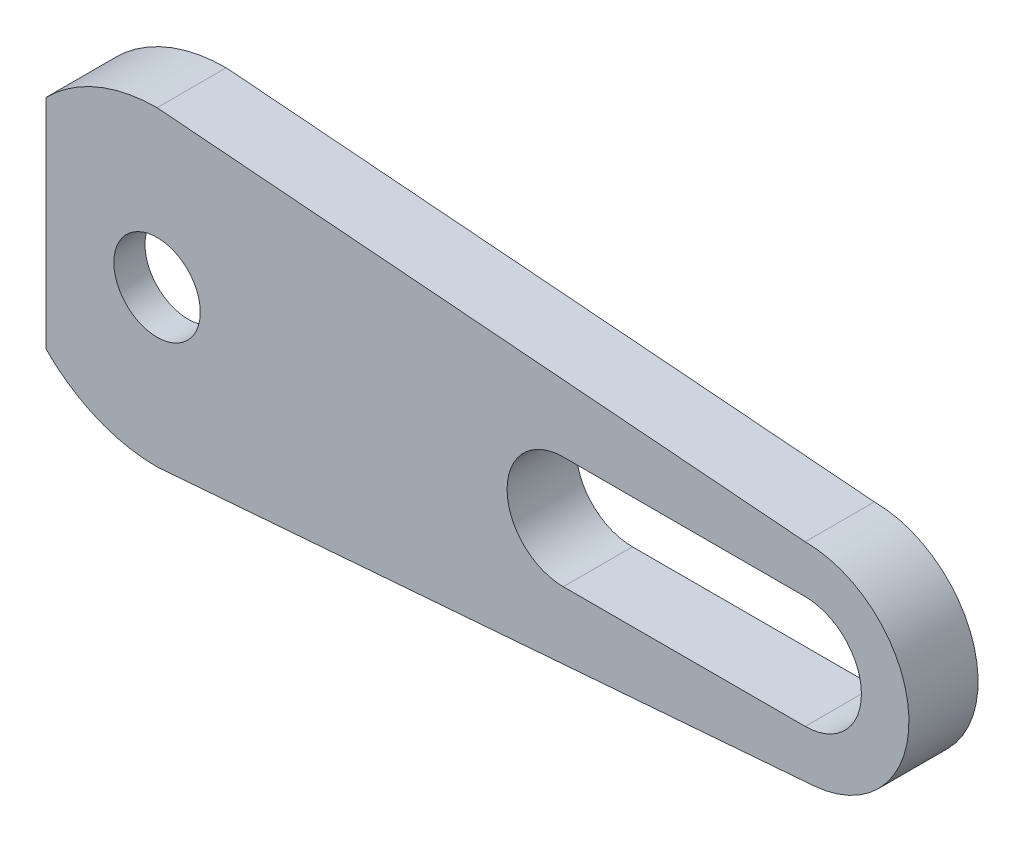
ISO-10303-21;
HEADER;
FILE_DESCRIPTION(('STEP AP214'),'2;1');
FILE_NAME('part.step','',(''),(''),'','','');
FILE_SCHEMA(('AUTOMOTIVE_DESIGN { 1 0 10303 214 1 1 1 1 }'));
ENDSEC;
DATA;
#1=APPLICATION_CONTEXT('core data for automotive mechanical design processes');
#2=APPLICATION_PROTOCOL_DEFINITION('international standard','automotive_design',2000,#1);
#3=PRODUCT_CONTEXT('',#1,'mechanical');
#4=PRODUCT('Part','Part','',(#3));
#5=PRODUCT_RELATED_PRODUCT_CATEGORY('part','',(#4));
#6=PRODUCT_DEFINITION_FORMATION('','',#4);
#7=PRODUCT_DEFINITION_CONTEXT('part definition',#1,'design');
#8=PRODUCT_DEFINITION('design','',#6,#7);
#9=PRODUCT_DEFINITION_SHAPE('','',#8);
#10=(LENGTH_UNIT() NAMED_UNIT(*) SI_UNIT(.MILLI.,.METRE.));
#11=(NAMED_UNIT(*) PLANE_ANGLE_UNIT() SI_UNIT($,.RADIAN.));
#12=(NAMED_UNIT(*) SI_UNIT($,.STERADIAN.) SOLID_ANGLE_UNIT());
#13=UNCERTAINTY_MEASURE_WITH_UNIT(LENGTH_MEASURE(1.E-05),#10,'distance_accuracy_value','');
#14=(GEOMETRIC_REPRESENTATION_CONTEXT(3) GLOBAL_UNCERTAINTY_ASSIGNED_CONTEXT((#13)) GLOBAL_UNIT_ASSIGNED_CONTEXT((#10,
#11,#12)) REPRESENTATION_CONTEXT('',''));
#15=CARTESIAN_POINT('',(0.,0.,0.));
#16=DIRECTION('',(0.,0.,1.));
#17=DIRECTION('',(1.,0.,0.));
#18=AXIS2_PLACEMENT_3D('',#15,#16,#17);
#19=CARTESIAN_POINT('',(0.,0.,4.));
#20=DIRECTION('',(0.,0.,-1.));
#21=DIRECTION('',(-1.,0.,0.));
#22=AXIS2_PLACEMENT_3D('',#19,#20,#21);
#23=PLANE('',#22);
#24=DIRECTION('',(1.,0.,0.));
#25=VECTOR('',#24,1.);
#26=CARTESIAN_POINT('',(23.5,-3.25,4.));
#27=LINE('',#26,#25);
#28=CARTESIAN_POINT('',(23.5,-3.25,4.));
#29=VERTEX_POINT('',#28);
#30=CARTESIAN_POINT('',(37.5,-3.25,4.));
#31=VERTEX_POINT('',#30);
#32=EDGE_CURVE('E272',#29,#31,#27,.T.);
#33=ORIENTED_EDGE('',*,*,#32,.F.);
#34=CARTESIAN_POINT('',(23.5,0.,4.));
#35=DIRECTION('',(0.,0.,1.));
#36=DIRECTION('',(1.,0.,0.));
#37=AXIS2_PLACEMENT_3D('',#34,#35,#36);
#38=CIRCLE('',#37,3.25);
#39=CARTESIAN_POINT('',(23.5,3.25,4.));
#40=VERTEX_POINT('',#39);
#41=EDGE_CURVE('E260',#40,#29,#38,.T.);
#42=ORIENTED_EDGE('',*,*,#41,.F.);
#43=DIRECTION('',(-1.,0.,0.));
#44=VECTOR('',#43,1.);
#45=CARTESIAN_POINT('',(23.5,3.25,4.));
#46=LINE('',#45,#44);
#47=CARTESIAN_POINT('',(37.5,3.25,4.));
#48=VERTEX_POINT('',#47);
#49=EDGE_CURVE('E256',#48,#40,#46,.T.);
#50=ORIENTED_EDGE('',*,*,#49,.F.);
#51=CARTESIAN_POINT('',(37.5,0.,4.));
#52=DIRECTION('',(0.,0.,1.));
#53=DIRECTION('',(-1.,0.,0.));
#54=AXIS2_PLACEMENT_3D('',#51,#52,#53);
#55=CIRCLE('',#54,3.25);
#56=EDGE_CURVE('E270',#31,#48,#55,.T.);
#57=ORIENTED_EDGE('',*,*,#56,.F.);
#58=EDGE_LOOP('',(#33,#42,#50,#57));
#59=FACE_BOUND('',#58,.T.);
#60=DIRECTION('',(0.996855151225438,0.0792452362941052,0.));
#61=VECTOR('',#60,1.);
#62=CARTESIAN_POINT('',(0.,-9.,4.));
#63=LINE('',#62,#61);
#64=CARTESIAN_POINT('',(0.,-9.,4.));
#65=VERTEX_POINT('',#64);
#66=CARTESIAN_POINT('',(37.9754714177646,-5.98113090735263,4.));
#67=VERTEX_POINT('',#66);
#68=EDGE_CURVE('E243',#65,#67,#63,.T.);
#69=ORIENTED_EDGE('',*,*,#68,.T.);
#70=CARTESIAN_POINT('',(37.5,0.,4.));
#71=DIRECTION('',(0.,0.,1.));
#72=DIRECTION('',(-1.,0.,0.));
#73=AXIS2_PLACEMENT_3D('',#70,#71,#72);
#74=CIRCLE('',#73,6.);
#75=CARTESIAN_POINT('',(37.5,6.,4.));
#76=VERTEX_POINT('',#75);
#77=EDGE_CURVE('E241',#67,#76,#74,.T.);
#78=ORIENTED_EDGE('',*,*,#77,.T.);
#79=DIRECTION('',(-0.996815278536125,0.07974522228289,0.));
#80=VECTOR('',#79,1.);
#81=CARTESIAN_POINT('',(0.,9.,4.));
#82=LINE('',#81,#80);
#83=CARTESIAN_POINT('',(0.,9.,4.));
#84=VERTEX_POINT('',#83);
#85=EDGE_CURVE('E207',#76,#84,#82,.T.);
#86=ORIENTED_EDGE('',*,*,#85,.T.);
#87=CARTESIAN_POINT('',(0.,0.,4.));
#88=DIRECTION('',(0.,0.,1.));
#89=DIRECTION('',(-1.,0.,0.));
#90=AXIS2_PLACEMENT_3D('',#87,#88,#89);
#91=CIRCLE('',#90,9.);
#92=CARTESIAN_POINT('',(-6.42654307097902,6.30075742723457,4.));
#93=VERTEX_POINT('',#92);
#94=EDGE_CURVE('E211',#84,#93,#91,.T.);
#95=ORIENTED_EDGE('',*,*,#94,.T.);
#96=DIRECTION('',(0.,1.,0.));
#97=VECTOR('',#96,1.);
#98=CARTESIAN_POINT('',(-6.42654307097901,-6.30075742723457,4.));
#99=LINE('',#98,#97);
#100=CARTESIAN_POINT('',(-6.42654307097901,-6.30075742723457,4.));
#101=VERTEX_POINT('',#100);
#102=EDGE_CURVE('E160',#101,#93,#99,.T.);
#103=ORIENTED_EDGE('',*,*,#102,.F.);
#104=CARTESIAN_POINT('',(0.,0.,4.));
#105=DIRECTION('',(0.,0.,1.));
#106=DIRECTION('',(1.,0.,0.));
#107=AXIS2_PLACEMENT_3D('',#104,#105,#106);
#108=CIRCLE('',#107,9.);
#109=EDGE_CURVE('E245',#101,#65,#108,.T.);
#110=ORIENTED_EDGE('',*,*,#109,.T.);
#111=EDGE_LOOP('',(#69,#78,#86,#95,#103,#110));
#112=FACE_BOUND('',#111,.T.);
#113=CARTESIAN_POINT('',(0.,0.,4.));
#114=DIRECTION('',(0.,0.,-1.));
#115=DIRECTION('',(-1.,0.,0.));
#116=AXIS2_PLACEMENT_3D('',#113,#114,#115);
#117=CIRCLE('',#116,2.5);
#118=CARTESIAN_POINT('',(-2.5,0.,4.));
#119=VERTEX_POINT('',#118);
#120=EDGE_CURVE('E291',#119,#119,#117,.T.);
#121=ORIENTED_EDGE('',*,*,#120,.T.);
#122=EDGE_LOOP('',(#121));
#123=FACE_BOUND('',#122,.T.);
#124=ADVANCED_FACE('F35',(#59,#112,#123),#23,.F.);
#125=CARTESIAN_POINT('',(0.,0.,0.));
#126=DIRECTION('',(0.,0.,-1.));
#127=DIRECTION('',(-1.,0.,0.));
#128=AXIS2_PLACEMENT_3D('',#125,#126,#127);
#129=PLANE('',#128);
#130=CARTESIAN_POINT('',(0.,0.,0.));
#131=DIRECTION('',(0.,0.,1.));
#132=DIRECTION('',(-1.,0.,0.));
#133=AXIS2_PLACEMENT_3D('',#130,#131,#132);
#134=CIRCLE('',#133,9.);
#135=CARTESIAN_POINT('',(0.,9.,0.));
#136=VERTEX_POINT('',#135);
#137=CARTESIAN_POINT('',(-6.42654307097901,6.30075742723457,0.));
#138=VERTEX_POINT('',#137);
#139=EDGE_CURVE('E179',#136,#138,#134,.T.);
#140=ORIENTED_EDGE('',*,*,#139,.F.);
#141=DIRECTION('',(-0.996815278536125,0.07974522228289,0.));
#142=VECTOR('',#141,1.);
#143=CARTESIAN_POINT('',(0.,9.,0.));
#144=LINE('',#143,#142);
#145=CARTESIAN_POINT('',(37.5,6.,0.));
#146=VERTEX_POINT('',#145);
#147=EDGE_CURVE('E208',#146,#136,#144,.T.);
#148=ORIENTED_EDGE('',*,*,#147,.F.);
#149=CARTESIAN_POINT('',(37.5,0.,0.));
#150=DIRECTION('',(0.,0.,1.));
#151=DIRECTION('',(-1.,0.,0.));
#152=AXIS2_PLACEMENT_3D('',#149,#150,#151);
#153=CIRCLE('',#152,6.);
#154=CARTESIAN_POINT('',(37.9754714177646,-5.98113090735263,0.));
#155=VERTEX_POINT('',#154);
#156=EDGE_CURVE('E212',#155,#146,#153,.T.);
#157=ORIENTED_EDGE('',*,*,#156,.F.);
#158=DIRECTION('',(0.996855151225438,0.0792452362941052,0.));
#159=VECTOR('',#158,1.);
#160=CARTESIAN_POINT('',(0.,-9.,0.));
#161=LINE('',#160,#159);
#162=CARTESIAN_POINT('',(0.,-9.,0.));
#163=VERTEX_POINT('',#162);
#164=EDGE_CURVE('E214',#163,#155,#161,.T.);
#165=ORIENTED_EDGE('',*,*,#164,.F.);
#166=CARTESIAN_POINT('',(0.,0.,0.));
#167=DIRECTION('',(0.,0.,1.));
#168=DIRECTION('',(1.,0.,0.));
#169=AXIS2_PLACEMENT_3D('',#166,#167,#168);
#170=CIRCLE('',#169,9.);
#171=CARTESIAN_POINT('',(-6.42654307097901,-6.30075742723457,0.));
#172=VERTEX_POINT('',#171);
#173=EDGE_CURVE('E216',#172,#163,#170,.T.);
#174=ORIENTED_EDGE('',*,*,#173,.F.);
#175=DIRECTION('',(-0.707106781186548,-0.707106781186548,0.));
#176=VECTOR('',#175,1.);
#177=CARTESIAN_POINT('',(-4.37578564374445,-4.25,0.));
#178=LINE('',#177,#176);
#179=CARTESIAN_POINT('',(-4.37578564374444,-4.25,0.));
#180=VERTEX_POINT('',#179);
#181=EDGE_CURVE('E219',#180,#172,#178,.T.);
#182=ORIENTED_EDGE('',*,*,#181,.F.);
#183=CARTESIAN_POINT('',(0.,0.,0.));
#184=DIRECTION('',(0.,0.,-1.));
#185=DIRECTION('',(-1.,0.,0.));
#186=AXIS2_PLACEMENT_3D('',#183,#184,#185);
#187=CIRCLE('',#186,6.1);
#188=CARTESIAN_POINT('',(4.37578564374445,-4.25,0.));
#189=VERTEX_POINT('',#188);
#190=EDGE_CURVE('E222',#189,#180,#187,.T.);
#191=ORIENTED_EDGE('',*,*,#190,.F.);
#192=DIRECTION('',(-0.993627549913592,-0.112713317991759,0.));
#193=VECTOR('',#192,1.);
#194=CARTESIAN_POINT('',(17.3155972903769,-2.78215713975806,0.));
#195=LINE('',#194,#193);
#196=CARTESIAN_POINT('',(17.3155972903769,-2.78215713975806,0.));
#197=VERTEX_POINT('',#196);
#198=EDGE_CURVE('E225',#197,#189,#195,.T.);
#199=ORIENTED_EDGE('',*,*,#198,.F.);
#200=CARTESIAN_POINT('',(17.,0.,0.));
#201=DIRECTION('',(0.,0.,-1.));
#202=DIRECTION('',(1.,0.,0.));
#203=AXIS2_PLACEMENT_3D('',#200,#201,#202);
#204=CIRCLE('',#203,2.8);
#205=CARTESIAN_POINT('',(17.3155972903769,2.78215713975806,0.));
#206=VERTEX_POINT('',#205);
#207=EDGE_CURVE('E228',#206,#197,#204,.T.);
#208=ORIENTED_EDGE('',*,*,#207,.F.);
#209=DIRECTION('',(0.993627549913592,-0.112713317991759,0.));
#210=VECTOR('',#209,1.);
#211=CARTESIAN_POINT('',(4.37578564374445,4.25,0.));
#212=LINE('',#211,#210);
#213=CARTESIAN_POINT('',(4.37578564374445,4.25,0.));
#214=VERTEX_POINT('',#213);
#215=EDGE_CURVE('E231',#214,#206,#212,.T.);
#216=ORIENTED_EDGE('',*,*,#215,.F.);
#217=CARTESIAN_POINT('',(0.,0.,0.));
#218=DIRECTION('',(0.,0.,-1.));
#219=DIRECTION('',(1.,0.,0.));
#220=AXIS2_PLACEMENT_3D('',#217,#218,#219);
#221=CIRCLE('',#220,6.1);
#222=CARTESIAN_POINT('',(-4.37578564374445,4.25,0.));
#223=VERTEX_POINT('',#222);
#224=EDGE_CURVE('E234',#223,#214,#221,.T.);
#225=ORIENTED_EDGE('',*,*,#224,.F.);
#226=DIRECTION('',(0.707106781186548,-0.707106781186548,0.));
#227=VECTOR('',#226,1.);
#228=CARTESIAN_POINT('',(-4.37578564374445,4.25,0.));
#229=LINE('',#228,#227);
#230=EDGE_CURVE('E236',#138,#223,#229,.T.);
#231=ORIENTED_EDGE('',*,*,#230,.F.);
#232=EDGE_LOOP('',(#140,#148,#157,#165,#174,#182,#191,#199,#208,#216,#225,#231));
#233=FACE_BOUND('',#232,.T.);
#234=DIRECTION('',(-1.,0.,0.));
#235=VECTOR('',#234,1.);
#236=CARTESIAN_POINT('',(23.5,3.25,0.));
#237=LINE('',#236,#235);
#238=CARTESIAN_POINT('',(37.5,3.25,0.));
#239=VERTEX_POINT('',#238);
#240=CARTESIAN_POINT('',(23.5,3.25,0.));
#241=VERTEX_POINT('',#240);
#242=EDGE_CURVE('E257',#239,#241,#237,.T.);
#243=ORIENTED_EDGE('',*,*,#242,.T.);
#244=CARTESIAN_POINT('',(23.5,0.,0.));
#245=DIRECTION('',(0.,0.,1.));
#246=DIRECTION('',(1.,0.,0.));
#247=AXIS2_PLACEMENT_3D('',#244,#245,#246);
#248=CIRCLE('',#247,3.25);
#249=CARTESIAN_POINT('',(23.5,-3.25,0.));
#250=VERTEX_POINT('',#249);
#251=EDGE_CURVE('E174',#241,#250,#248,.T.);
#252=ORIENTED_EDGE('',*,*,#251,.T.);
#253=DIRECTION('',(1.,0.,0.));
#254=VECTOR('',#253,1.);
#255=CARTESIAN_POINT('',(23.5,-3.25,0.));
#256=LINE('',#255,#254);
#257=CARTESIAN_POINT('',(37.5,-3.25,0.));
#258=VERTEX_POINT('',#257);
#259=EDGE_CURVE('E264',#250,#258,#256,.T.);
#260=ORIENTED_EDGE('',*,*,#259,.T.);
#261=CARTESIAN_POINT('',(37.5,0.,0.));
#262=DIRECTION('',(0.,0.,1.));
#263=DIRECTION('',(-1.,0.,0.));
#264=AXIS2_PLACEMENT_3D('',#261,#262,#263);
#265=CIRCLE('',#264,3.25);
#266=EDGE_CURVE('E261',#258,#239,#265,.T.);
#267=ORIENTED_EDGE('',*,*,#266,.T.);
#268=EDGE_LOOP('',(#243,#252,#260,#267));
#269=FACE_BOUND('',#268,.T.);
#270=ADVANCED_FACE('F311',(#233,#269),#129,.T.);
#271=CARTESIAN_POINT('',(0.,0.,4.));
#272=DIRECTION('',(0.,0.,-1.));
#273=DIRECTION('',(-1.,0.,0.));
#274=AXIS2_PLACEMENT_3D('',#271,#272,#273);
#275=CYLINDRICAL_SURFACE('',#274,9.);
#276=DIRECTION('',(0.,0.,-1.));
#277=VECTOR('',#276,1.);
#278=CARTESIAN_POINT('',(-6.42654307097901,6.30075742723457,4.));
#279=LINE('',#278,#277);
#280=CARTESIAN_POINT('',(-6.42654307097902,6.30075742723457,2.2));
#281=VERTEX_POINT('',#280);
#282=EDGE_CURVE('E43',#281,#138,#279,.T.);
#283=ORIENTED_EDGE('',*,*,#282,.F.);
#284=EDGE_CURVE('E11',#93,#281,#279,.T.);
#285=ORIENTED_EDGE('',*,*,#284,.F.);
#286=ORIENTED_EDGE('',*,*,#94,.F.);
#287=DIRECTION('',(0.,0.,-1.));
#288=VECTOR('',#287,1.);
#289=CARTESIAN_POINT('',(0.,9.,4.));
#290=LINE('',#289,#288);
#291=EDGE_CURVE('E205',#84,#136,#290,.T.);
#292=ORIENTED_EDGE('',*,*,#291,.T.);
#293=ORIENTED_EDGE('',*,*,#139,.T.);
#294=EDGE_LOOP('',(#283,#285,#286,#292,#293));
#295=FACE_BOUND('',#294,.T.);
#296=ADVANCED_FACE('F37',(#295),#275,.T.);
#297=CARTESIAN_POINT('',(-4.37578564374445,4.25,4.));
#298=DIRECTION('',(0.707106781186547,0.707106781186547,0.));
#299=DIRECTION('',(-0.707106781186548,0.707106781186548,0.));
#300=AXIS2_PLACEMENT_3D('',#297,#298,#299);
#301=PLANE('',#300);
#302=DIRECTION('',(0.,0.,-1.));
#303=VECTOR('',#302,1.);
#304=CARTESIAN_POINT('',(-4.37578564374445,4.25,4.));
#305=LINE('',#304,#303);
#306=CARTESIAN_POINT('',(-4.37578564374445,4.25,2.2));
#307=VERTEX_POINT('',#306);
#308=EDGE_CURVE('E173',#307,#223,#305,.T.);
#309=ORIENTED_EDGE('',*,*,#308,.F.);
#310=DIRECTION('',(-0.707106781186548,0.707106781186548,0.));
#311=VECTOR('',#310,1.);
#312=CARTESIAN_POINT('',(-4.37578564374445,4.25,2.2));
#313=LINE('',#312,#311);
#314=EDGE_CURVE('E155',#307,#281,#313,.T.);
#315=ORIENTED_EDGE('',*,*,#314,.T.);
#316=ORIENTED_EDGE('',*,*,#282,.T.);
#317=ORIENTED_EDGE('',*,*,#230,.T.);
#318=EDGE_LOOP('',(#309,#315,#316,#317));
#319=FACE_BOUND('',#318,.T.);
#320=ADVANCED_FACE('F170',(#319),#301,.F.);
#321=CARTESIAN_POINT('',(0.,0.,4.));
#322=DIRECTION('',(0.,0.,-1.));
#323=DIRECTION('',(-1.,0.,0.));
#324=AXIS2_PLACEMENT_3D('',#321,#322,#323);
#325=CYLINDRICAL_SURFACE('',#324,6.1);
#326=DIRECTION('',(0.,0.,-1.));
#327=VECTOR('',#326,1.);
#328=CARTESIAN_POINT('',(4.37578564374445,4.25,4.));
#329=LINE('',#328,#327);
#330=CARTESIAN_POINT('',(4.37578564374445,4.25,2.2));
#331=VERTEX_POINT('',#330);
#332=EDGE_CURVE('E180',#331,#214,#329,.T.);
#333=ORIENTED_EDGE('',*,*,#332,.F.);
#334=CARTESIAN_POINT('',(0.,0.,2.2));
#335=DIRECTION('',(0.,0.,-1.));
#336=DIRECTION('',(-1.,0.,0.));
#337=AXIS2_PLACEMENT_3D('',#334,#335,#336);
#338=CIRCLE('',#337,6.1);
#339=EDGE_CURVE('E175',#331,#307,#338,.F.);
#340=ORIENTED_EDGE('',*,*,#339,.T.);
#341=ORIENTED_EDGE('',*,*,#308,.T.);
#342=ORIENTED_EDGE('',*,*,#224,.T.);
#343=EDGE_LOOP('',(#333,#340,#341,#342));
#344=FACE_BOUND('',#343,.T.);
#345=ADVANCED_FACE('F360',(#344),#325,.F.);
#346=CARTESIAN_POINT('',(4.37578564374445,4.25,4.));
#347=DIRECTION('',(0.112713317991759,0.993627549913592,0.));
#348=DIRECTION('',(-0.993627549913592,0.112713317991759,0.));
#349=AXIS2_PLACEMENT_3D('',#346,#347,#348);
#350=PLANE('',#349);
#351=DIRECTION('',(0.,0.,-1.));
#352=VECTOR('',#351,1.);
#353=CARTESIAN_POINT('',(17.3155972903769,2.78215713975806,4.));
#354=LINE('',#353,#352);
#355=CARTESIAN_POINT('',(17.3155972903769,2.78215713975806,2.2));
#356=VERTEX_POINT('',#355);
#357=EDGE_CURVE('E183',#356,#206,#354,.T.);
#358=ORIENTED_EDGE('',*,*,#357,.F.);
#359=DIRECTION('',(-0.993627549913592,0.112713317991759,0.));
#360=VECTOR('',#359,1.);
#361=CARTESIAN_POINT('',(4.37578564374445,4.25,2.2));
#362=LINE('',#361,#360);
#363=EDGE_CURVE('E276',#356,#331,#362,.T.);
#364=ORIENTED_EDGE('',*,*,#363,.T.);
#365=ORIENTED_EDGE('',*,*,#332,.T.);
#366=ORIENTED_EDGE('',*,*,#215,.T.);
#367=EDGE_LOOP('',(#358,#364,#365,#366));
#368=FACE_BOUND('',#367,.T.);
#369=ADVANCED_FACE('F356',(#368),#350,.F.);
#370=CARTESIAN_POINT('',(17.,0.,4.));
#371=DIRECTION('',(0.,0.,-1.));
#372=DIRECTION('',(-1.,0.,0.));
#373=AXIS2_PLACEMENT_3D('',#370,#371,#372);
#374=CYLINDRICAL_SURFACE('',#373,2.8);
#375=DIRECTION('',(0.,0.,-1.));
#376=VECTOR('',#375,1.);
#377=CARTESIAN_POINT('',(17.3155972903769,-2.78215713975806,4.));
#378=LINE('',#377,#376);
#379=CARTESIAN_POINT('',(17.3155972903769,-2.78215713975806,2.2));
#380=VERTEX_POINT('',#379);
#381=EDGE_CURVE('E187',#380,#197,#378,.T.);
#382=ORIENTED_EDGE('',*,*,#381,.F.);
#383=CARTESIAN_POINT('',(17.,0.,2.2));
#384=DIRECTION('',(0.,0.,-1.));
#385=DIRECTION('',(-1.,0.,0.));
#386=AXIS2_PLACEMENT_3D('',#383,#384,#385);
#387=CIRCLE('',#386,2.8);
#388=EDGE_CURVE('E279',#380,#356,#387,.F.);
#389=ORIENTED_EDGE('',*,*,#388,.T.);
#390=ORIENTED_EDGE('',*,*,#357,.T.);
#391=ORIENTED_EDGE('',*,*,#207,.T.);
#392=EDGE_LOOP('',(#382,#389,#390,#391));
#393=FACE_BOUND('',#392,.T.);
#394=ADVANCED_FACE('F352',(#393),#374,.F.);
#395=CARTESIAN_POINT('',(17.3155972903769,-2.78215713975806,4.));
#396=DIRECTION('',(0.112713317991759,-0.993627549913592,0.));
#397=DIRECTION('',(0.993627549913592,0.112713317991759,0.));
#398=AXIS2_PLACEMENT_3D('',#395,#396,#397);
#399=PLANE('',#398);
#400=DIRECTION('',(0.,0.,-1.));
#401=VECTOR('',#400,1.);
#402=CARTESIAN_POINT('',(4.37578564374445,-4.25,4.));
#403=LINE('',#402,#401);
#404=CARTESIAN_POINT('',(4.37578564374445,-4.25,2.2));
#405=VERTEX_POINT('',#404);
#406=EDGE_CURVE('E189',#405,#189,#403,.T.);
#407=ORIENTED_EDGE('',*,*,#406,.F.);
#408=DIRECTION('',(0.993627549913592,0.112713317991759,0.));
#409=VECTOR('',#408,1.);
#410=CARTESIAN_POINT('',(17.3155972903769,-2.78215713975806,2.2));
#411=LINE('',#410,#409);
#412=EDGE_CURVE('E282',#405,#380,#411,.T.);
#413=ORIENTED_EDGE('',*,*,#412,.T.);
#414=ORIENTED_EDGE('',*,*,#381,.T.);
#415=ORIENTED_EDGE('',*,*,#198,.T.);
#416=EDGE_LOOP('',(#407,#413,#414,#415));
#417=FACE_BOUND('',#416,.T.);
#418=ADVANCED_FACE('F348',(#417),#399,.F.);
#419=CARTESIAN_POINT('',(0.,0.,4.));
#420=DIRECTION('',(0.,0.,-1.));
#421=DIRECTION('',(-1.,0.,0.));
#422=AXIS2_PLACEMENT_3D('',#419,#420,#421);
#423=CYLINDRICAL_SURFACE('',#422,6.1);
#424=DIRECTION('',(0.,0.,-1.));
#425=VECTOR('',#424,1.);
#426=CARTESIAN_POINT('',(-4.37578564374444,-4.25,4.));
#427=LINE('',#426,#425);
#428=CARTESIAN_POINT('',(-4.37578564374445,-4.25,2.2));
#429=VERTEX_POINT('',#428);
#430=EDGE_CURVE('E191',#429,#180,#427,.T.);
#431=ORIENTED_EDGE('',*,*,#430,.F.);
#432=CARTESIAN_POINT('',(0.,0.,2.2));
#433=DIRECTION('',(0.,0.,-1.));
#434=DIRECTION('',(-1.,0.,0.));
#435=AXIS2_PLACEMENT_3D('',#432,#433,#434);
#436=CIRCLE('',#435,6.1);
#437=EDGE_CURVE('E285',#429,#405,#436,.F.);
#438=ORIENTED_EDGE('',*,*,#437,.T.);
#439=ORIENTED_EDGE('',*,*,#406,.T.);
#440=ORIENTED_EDGE('',*,*,#190,.T.);
#441=EDGE_LOOP('',(#431,#438,#439,#440));
#442=FACE_BOUND('',#441,.T.);
#443=ADVANCED_FACE('F344',(#442),#423,.F.);
#444=CARTESIAN_POINT('',(-4.37578564374445,-4.25,4.));
#445=DIRECTION('',(0.707106781186547,-0.707106781186547,0.));
#446=DIRECTION('',(0.707106781186548,0.707106781186548,0.));
#447=AXIS2_PLACEMENT_3D('',#444,#445,#446);
#448=PLANE('',#447);
#449=DIRECTION('',(0.,0.,-1.));
#450=VECTOR('',#449,1.);
#451=CARTESIAN_POINT('',(-6.42654307097901,-6.30075742723457,4.));
#452=LINE('',#451,#450);
#453=CARTESIAN_POINT('',(-6.42654307097901,-6.30075742723457,2.2));
#454=VERTEX_POINT('',#453);
#455=EDGE_CURVE('E196',#454,#172,#452,.T.);
#456=ORIENTED_EDGE('',*,*,#455,.F.);
#457=DIRECTION('',(0.707106781186548,0.707106781186548,0.));
#458=VECTOR('',#457,1.);
#459=CARTESIAN_POINT('',(-4.37578564374445,-4.25,2.2));
#460=LINE('',#459,#458);
#461=EDGE_CURVE('E158',#454,#429,#460,.T.);
#462=ORIENTED_EDGE('',*,*,#461,.T.);
#463=ORIENTED_EDGE('',*,*,#430,.T.);
#464=ORIENTED_EDGE('',*,*,#181,.T.);
#465=EDGE_LOOP('',(#456,#462,#463,#464));
#466=FACE_BOUND('',#465,.T.);
#467=ADVANCED_FACE('F340',(#466),#448,.F.);
#468=CARTESIAN_POINT('',(0.,0.,4.));
#469=DIRECTION('',(0.,0.,-1.));
#470=DIRECTION('',(-1.,0.,0.));
#471=AXIS2_PLACEMENT_3D('',#468,#469,#470);
#472=CYLINDRICAL_SURFACE('',#471,9.);
#473=ORIENTED_EDGE('',*,*,#173,.T.);
#474=DIRECTION('',(0.,0.,-1.));
#475=VECTOR('',#474,1.);
#476=CARTESIAN_POINT('',(0.,-9.,4.));
#477=LINE('',#476,#475);
#478=EDGE_CURVE('E197',#65,#163,#477,.T.);
#479=ORIENTED_EDGE('',*,*,#478,.F.);
#480=ORIENTED_EDGE('',*,*,#109,.F.);
#481=EDGE_CURVE('E193',#101,#454,#452,.T.);
#482=ORIENTED_EDGE('',*,*,#481,.T.);
#483=ORIENTED_EDGE('',*,*,#455,.T.);
#484=EDGE_LOOP('',(#473,#479,#480,#482,#483));
#485=FACE_BOUND('',#484,.T.);
#486=ADVANCED_FACE('F336',(#485),#472,.T.);
#487=CARTESIAN_POINT('',(0.,-9.,4.));
#488=DIRECTION('',(-0.0792452362941052,0.996855151225438,0.));
#489=DIRECTION('',(-0.996855151225438,-0.0792452362941052,0.));
#490=AXIS2_PLACEMENT_3D('',#487,#488,#489);
#491=PLANE('',#490);
#492=ORIENTED_EDGE('',*,*,#478,.T.);
#493=ORIENTED_EDGE('',*,*,#164,.T.);
#494=DIRECTION('',(0.,0.,-1.));
#495=VECTOR('',#494,1.);
#496=CARTESIAN_POINT('',(37.9754714177646,-5.98113090735263,4.));
#497=LINE('',#496,#495);
#498=EDGE_CURVE('E199',#67,#155,#497,.T.);
#499=ORIENTED_EDGE('',*,*,#498,.F.);
#500=ORIENTED_EDGE('',*,*,#68,.F.);
#501=EDGE_LOOP('',(#492,#493,#499,#500));
#502=FACE_BOUND('',#501,.T.);
#503=ADVANCED_FACE('F332',(#502),#491,.F.);
#504=CARTESIAN_POINT('',(37.5,0.,4.));
#505=DIRECTION('',(0.,0.,-1.));
#506=DIRECTION('',(-1.,0.,0.));
#507=AXIS2_PLACEMENT_3D('',#504,#505,#506);
#508=CYLINDRICAL_SURFACE('',#507,6.);
#509=ORIENTED_EDGE('',*,*,#156,.T.);
#510=DIRECTION('',(0.,0.,-1.));
#511=VECTOR('',#510,1.);
#512=CARTESIAN_POINT('',(37.5,6.,4.));
#513=LINE('',#512,#511);
#514=EDGE_CURVE('E202',#76,#146,#513,.T.);
#515=ORIENTED_EDGE('',*,*,#514,.F.);
#516=ORIENTED_EDGE('',*,*,#77,.F.);
#517=ORIENTED_EDGE('',*,*,#498,.T.);
#518=EDGE_LOOP('',(#509,#515,#516,#517));
#519=FACE_BOUND('',#518,.T.);
#520=ADVANCED_FACE('F328',(#519),#508,.T.);
#521=CARTESIAN_POINT('',(0.,9.,4.));
#522=DIRECTION('',(-0.07974522228289,-0.996815278536125,0.));
#523=DIRECTION('',(0.996815278536125,-0.07974522228289,0.));
#524=AXIS2_PLACEMENT_3D('',#521,#522,#523);
#525=PLANE('',#524);
#526=ORIENTED_EDGE('',*,*,#147,.T.);
#527=ORIENTED_EDGE('',*,*,#291,.F.);
#528=ORIENTED_EDGE('',*,*,#85,.F.);
#529=ORIENTED_EDGE('',*,*,#514,.T.);
#530=EDGE_LOOP('',(#526,#527,#528,#529));
#531=FACE_BOUND('',#530,.T.);
#532=ADVANCED_FACE('F325',(#531),#525,.F.);
#533=CARTESIAN_POINT('',(23.5,0.,4.));
#534=DIRECTION('',(0.,0.,-1.));
#535=DIRECTION('',(-1.,0.,0.));
#536=AXIS2_PLACEMENT_3D('',#533,#534,#535);
#537=CYLINDRICAL_SURFACE('',#536,3.25);
#538=ORIENTED_EDGE('',*,*,#41,.T.);
#539=DIRECTION('',(0.,0.,-1.));
#540=VECTOR('',#539,1.);
#541=CARTESIAN_POINT('',(23.5,-3.25,4.));
#542=LINE('',#541,#540);
#543=EDGE_CURVE('E239',#29,#250,#542,.T.);
#544=ORIENTED_EDGE('',*,*,#543,.T.);
#545=ORIENTED_EDGE('',*,*,#251,.F.);
#546=DIRECTION('',(0.,0.,-1.));
#547=VECTOR('',#546,1.);
#548=CARTESIAN_POINT('',(23.5,3.25,4.));
#549=LINE('',#548,#547);
#550=EDGE_CURVE('E253',#40,#241,#549,.T.);
#551=ORIENTED_EDGE('',*,*,#550,.F.);
#552=EDGE_LOOP('',(#538,#544,#545,#551));
#553=FACE_BOUND('',#552,.T.);
#554=ADVANCED_FACE('F322',(#553),#537,.F.);
#555=CARTESIAN_POINT('',(23.5,-3.25,4.));
#556=DIRECTION('',(0.,1.,0.));
#557=DIRECTION('',(-1.,0.,0.));
#558=AXIS2_PLACEMENT_3D('',#555,#556,#557);
#559=PLANE('',#558);
#560=ORIENTED_EDGE('',*,*,#259,.F.);
#561=ORIENTED_EDGE('',*,*,#543,.F.);
#562=ORIENTED_EDGE('',*,*,#32,.T.);
#563=DIRECTION('',(0.,0.,-1.));
#564=VECTOR('',#563,1.);
#565=CARTESIAN_POINT('',(37.5,-3.25,4.));
#566=LINE('',#565,#564);
#567=EDGE_CURVE('E250',#31,#258,#566,.T.);
#568=ORIENTED_EDGE('',*,*,#567,.T.);
#569=EDGE_LOOP('',(#560,#561,#562,#568));
#570=FACE_BOUND('',#569,.T.);
#571=ADVANCED_FACE('F387',(#570),#559,.T.);
#572=CARTESIAN_POINT('',(37.5,0.,4.));
#573=DIRECTION('',(0.,0.,-1.));
#574=DIRECTION('',(-1.,0.,0.));
#575=AXIS2_PLACEMENT_3D('',#572,#573,#574);
#576=CYLINDRICAL_SURFACE('',#575,3.25);
#577=ORIENTED_EDGE('',*,*,#266,.F.);
#578=ORIENTED_EDGE('',*,*,#567,.F.);
#579=ORIENTED_EDGE('',*,*,#56,.T.);
#580=DIRECTION('',(0.,0.,-1.));
#581=VECTOR('',#580,1.);
#582=CARTESIAN_POINT('',(37.5,3.25,4.));
#583=LINE('',#582,#581);
#584=EDGE_CURVE('E57',#48,#239,#583,.T.);
#585=ORIENTED_EDGE('',*,*,#584,.T.);
#586=EDGE_LOOP('',(#577,#578,#579,#585));
#587=FACE_BOUND('',#586,.T.);
#588=ADVANCED_FACE('F307',(#587),#576,.F.);
#589=CARTESIAN_POINT('',(23.5,3.25,4.));
#590=DIRECTION('',(0.,-1.,0.));
#591=DIRECTION('',(1.,0.,0.));
#592=AXIS2_PLACEMENT_3D('',#589,#590,#591);
#593=PLANE('',#592);
#594=ORIENTED_EDGE('',*,*,#242,.F.);
#595=ORIENTED_EDGE('',*,*,#584,.F.);
#596=ORIENTED_EDGE('',*,*,#49,.T.);
#597=ORIENTED_EDGE('',*,*,#550,.T.);
#598=EDGE_LOOP('',(#594,#595,#596,#597));
#599=FACE_BOUND('',#598,.T.);
#600=ADVANCED_FACE('F300',(#599),#593,.T.);
#601=CARTESIAN_POINT('',(0.,0.,2.2));
#602=DIRECTION('',(0.,0.,-1.));
#603=DIRECTION('',(-1.,0.,0.));
#604=AXIS2_PLACEMENT_3D('',#601,#602,#603);
#605=PLANE('',#604);
#606=ORIENTED_EDGE('',*,*,#314,.F.);
#607=ORIENTED_EDGE('',*,*,#339,.F.);
#608=ORIENTED_EDGE('',*,*,#363,.F.);
#609=ORIENTED_EDGE('',*,*,#388,.F.);
#610=ORIENTED_EDGE('',*,*,#412,.F.);
#611=ORIENTED_EDGE('',*,*,#437,.F.);
#612=ORIENTED_EDGE('',*,*,#461,.F.);
#613=DIRECTION('',(0.,1.,0.));
#614=VECTOR('',#613,1.);
#615=CARTESIAN_POINT('',(-6.42654307097901,-6.30075742723457,2.2));
#616=LINE('',#615,#614);
#617=EDGE_CURVE('E49',#454,#281,#616,.T.);
#618=ORIENTED_EDGE('',*,*,#617,.T.);
#619=EDGE_LOOP('',(#606,#607,#608,#609,#610,#611,#612,#618));
#620=FACE_BOUND('',#619,.T.);
#621=CARTESIAN_POINT('',(0.,0.,2.2));
#622=DIRECTION('',(0.,0.,-1.));
#623=DIRECTION('',(-1.,0.,0.));
#624=AXIS2_PLACEMENT_3D('',#621,#622,#623);
#625=CIRCLE('',#624,2.5);
#626=CARTESIAN_POINT('',(-2.5,0.,2.2));
#627=VERTEX_POINT('',#626);
#628=EDGE_CURVE('E289',#627,#627,#625,.T.);
#629=ORIENTED_EDGE('',*,*,#628,.F.);
#630=EDGE_LOOP('',(#629));
#631=FACE_BOUND('',#630,.T.);
#632=ADVANCED_FACE('F152',(#620,#631),#605,.T.);
#633=CARTESIAN_POINT('',(-6.42654307097901,-6.30075742723457,2.2));
#634=DIRECTION('',(1.,0.,0.));
#635=DIRECTION('',(0.,0.,-1.));
#636=AXIS2_PLACEMENT_3D('',#633,#634,#635);
#637=PLANE('',#636);
#638=ORIENTED_EDGE('',*,*,#102,.T.);
#639=ORIENTED_EDGE('',*,*,#284,.T.);
#640=ORIENTED_EDGE('',*,*,#617,.F.);
#641=ORIENTED_EDGE('',*,*,#481,.F.);
#642=EDGE_LOOP('',(#638,#639,#640,#641));
#643=FACE_BOUND('',#642,.T.);
#644=ADVANCED_FACE('F163',(#643),#637,.F.);
#645=CARTESIAN_POINT('',(0.,0.,2.2));
#646=DIRECTION('',(0.,0.,1.));
#647=DIRECTION('',(1.,0.,0.));
#648=AXIS2_PLACEMENT_3D('',#645,#646,#647);
#649=CYLINDRICAL_SURFACE('',#648,2.5);
#650=ORIENTED_EDGE('',*,*,#628,.T.);
#651=EDGE_LOOP('',(#650));
#652=FACE_BOUND('',#651,.T.);
#653=ORIENTED_EDGE('',*,*,#120,.F.);
#654=EDGE_LOOP('',(#653));
#655=FACE_BOUND('',#654,.T.);
#656=ADVANCED_FACE('F297',(#652,#655),#649,.F.);
#657=CLOSED_SHELL('',(#124,#270,#296,#320,#345,#369,#394,#418,#443,#467,#486,#503,#520,#532,
#554,#571,#588,#600,#632,#644,#656));
#658=MANIFOLD_SOLID_BREP('B2',#657);
#659=ADVANCED_BREP_SHAPE_REPRESENTATION('',(#18,#658),#14);
#660=SHAPE_DEFINITION_REPRESENTATION(#9,#659);
ENDSEC;
END-ISO-10303-21;
